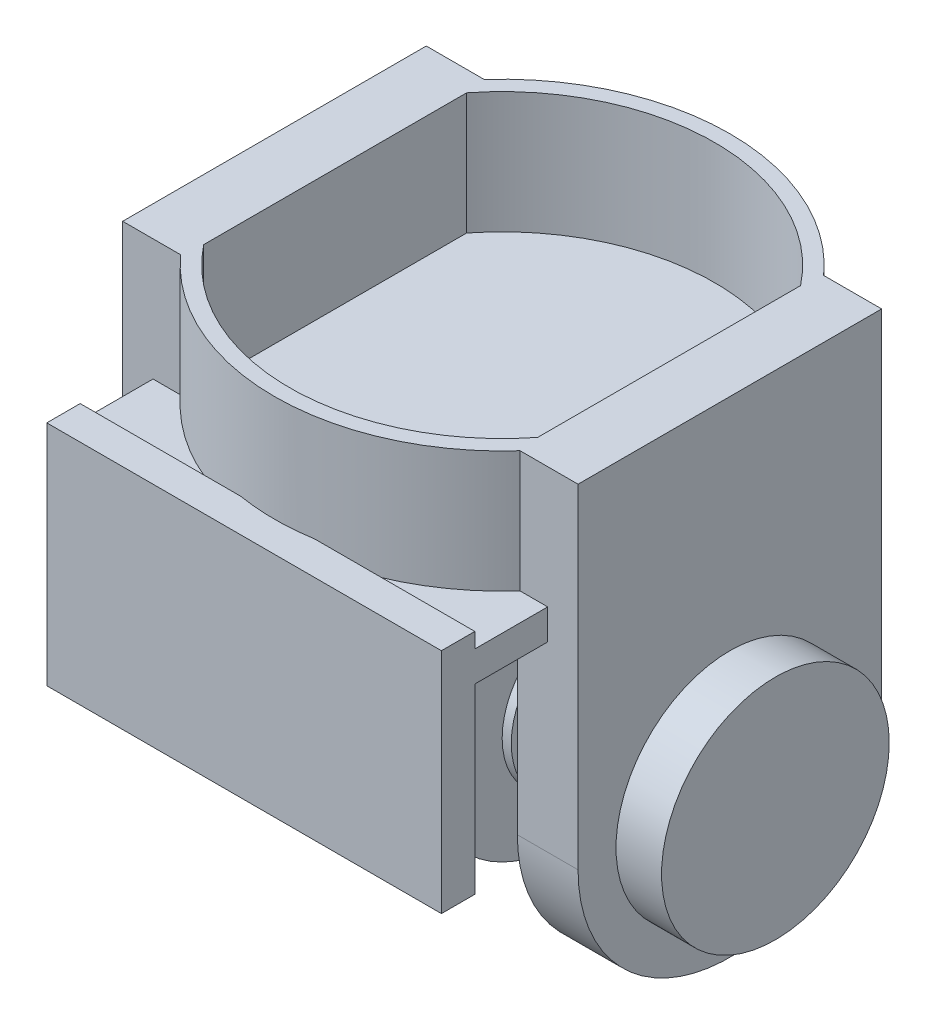
ISO-10303-21;
HEADER;
FILE_DESCRIPTION(('STEP AP214'),'2;1');
FILE_NAME('part.step','',(''),(''),'','','');
FILE_SCHEMA(('AUTOMOTIVE_DESIGN { 1 0 10303 214 1 1 1 1 }'));
ENDSEC;
DATA;
#1=APPLICATION_CONTEXT('core data for automotive mechanical design processes');
#2=APPLICATION_PROTOCOL_DEFINITION('international standard','automotive_design',2000,#1);
#3=PRODUCT_CONTEXT('',#1,'mechanical');
#4=PRODUCT('Part','Part','',(#3));
#5=PRODUCT_RELATED_PRODUCT_CATEGORY('part','',(#4));
#6=PRODUCT_DEFINITION_FORMATION('','',#4);
#7=PRODUCT_DEFINITION_CONTEXT('part definition',#1,'design');
#8=PRODUCT_DEFINITION('design','',#6,#7);
#9=PRODUCT_DEFINITION_SHAPE('','',#8);
#10=(LENGTH_UNIT() NAMED_UNIT(*) SI_UNIT(.MILLI.,.METRE.));
#11=(NAMED_UNIT(*) PLANE_ANGLE_UNIT() SI_UNIT($,.RADIAN.));
#12=(NAMED_UNIT(*) SI_UNIT($,.STERADIAN.) SOLID_ANGLE_UNIT());
#13=UNCERTAINTY_MEASURE_WITH_UNIT(LENGTH_MEASURE(1.E-05),#10,'distance_accuracy_value','');
#14=(GEOMETRIC_REPRESENTATION_CONTEXT(3) GLOBAL_UNCERTAINTY_ASSIGNED_CONTEXT((#13)) GLOBAL_UNIT_ASSIGNED_CONTEXT((#10,
#11,#12)) REPRESENTATION_CONTEXT('',''));
#15=CARTESIAN_POINT('',(0.,0.,0.));
#16=DIRECTION('',(0.,0.,1.));
#17=DIRECTION('',(1.,0.,0.));
#18=AXIS2_PLACEMENT_3D('',#15,#16,#17);
#19=CARTESIAN_POINT('',(25.,-60.,0.));
#20=DIRECTION('',(1.,0.,0.));
#21=DIRECTION('',(0.,0.,-1.));
#22=AXIS2_PLACEMENT_3D('',#19,#20,#21);
#23=CYLINDRICAL_SURFACE('',#22,25.);
#24=CARTESIAN_POINT('',(25.,-60.,0.));
#25=DIRECTION('',(-1.,0.,0.));
#26=DIRECTION('',(0.,0.,1.));
#27=AXIS2_PLACEMENT_3D('',#24,#25,#26);
#28=CIRCLE('',#27,25.);
#29=CARTESIAN_POINT('',(25.,-60.,25.));
#30=VERTEX_POINT('',#29);
#31=EDGE_CURVE('E11',#30,#30,#28,.T.);
#32=ORIENTED_EDGE('',*,*,#31,.F.);
#33=EDGE_LOOP('',(#32));
#34=FACE_BOUND('',#33,.T.);
#35=CARTESIAN_POINT('',(28.,-60.,0.));
#36=DIRECTION('',(-1.,0.,0.));
#37=DIRECTION('',(0.,0.,1.));
#38=AXIS2_PLACEMENT_3D('',#35,#36,#37);
#39=CIRCLE('',#38,25.);
#40=CARTESIAN_POINT('',(28.,-60.,25.));
#41=VERTEX_POINT('',#40);
#42=EDGE_CURVE('E46',#41,#41,#39,.T.);
#43=ORIENTED_EDGE('',*,*,#42,.T.);
#44=EDGE_LOOP('',(#43));
#45=FACE_BOUND('',#44,.T.);
#46=ADVANCED_FACE('F43',(#34,#45),#23,.T.);
#47=CARTESIAN_POINT('',(25.,-60.,0.));
#48=DIRECTION('',(-1.,0.,0.));
#49=DIRECTION('',(0.,0.,1.));
#50=AXIS2_PLACEMENT_3D('',#47,#48,#49);
#51=PLANE('',#50);
#52=ORIENTED_EDGE('',*,*,#31,.T.);
#53=EDGE_LOOP('',(#52));
#54=FACE_BOUND('',#53,.T.);
#55=ADVANCED_FACE('F58',(#54),#51,.T.);
#56=CARTESIAN_POINT('',(28.,-60.,0.));
#57=DIRECTION('',(-1.,0.,0.));
#58=DIRECTION('',(0.,0.,1.));
#59=AXIS2_PLACEMENT_3D('',#56,#57,#58);
#60=PLANE('',#59);
#61=ORIENTED_EDGE('',*,*,#42,.F.);
#62=EDGE_LOOP('',(#61));
#63=FACE_BOUND('',#62,.T.);
#64=ADVANCED_FACE('F56',(#63),#60,.F.);
#65=CLOSED_SHELL('',(#46,#55,#64));
#66=MANIFOLD_SOLID_BREP('B2',#65);
#67=CARTESIAN_POINT('',(7.00000000000002,-60.,0.));
#68=DIRECTION('',(1.,0.,0.));
#69=DIRECTION('',(0.,0.,-1.));
#70=AXIS2_PLACEMENT_3D('',#67,#68,#69);
#71=CYLINDRICAL_SURFACE('',#70,22.5);
#72=CARTESIAN_POINT('',(7.00000000000002,-60.,0.));
#73=DIRECTION('',(-1.,0.,0.));
#74=DIRECTION('',(0.,0.,1.));
#75=AXIS2_PLACEMENT_3D('',#72,#73,#74);
#76=CIRCLE('',#75,22.5);
#77=CARTESIAN_POINT('',(7.00000000000002,-60.,22.5));
#78=VERTEX_POINT('',#77);
#79=EDGE_CURVE('E42',#78,#78,#76,.T.);
#80=ORIENTED_EDGE('',*,*,#79,.F.);
#81=EDGE_LOOP('',(#80));
#82=FACE_BOUND('',#81,.T.);
#83=CARTESIAN_POINT('',(10.,-60.,0.));
#84=DIRECTION('',(-1.,0.,0.));
#85=DIRECTION('',(0.,0.,1.));
#86=AXIS2_PLACEMENT_3D('',#83,#84,#85);
#87=CIRCLE('',#86,22.5);
#88=CARTESIAN_POINT('',(10.,-60.,22.5));
#89=VERTEX_POINT('',#88);
#90=EDGE_CURVE('E94',#89,#89,#87,.T.);
#91=ORIENTED_EDGE('',*,*,#90,.T.);
#92=EDGE_LOOP('',(#91));
#93=FACE_BOUND('',#92,.T.);
#94=ADVANCED_FACE('F91',(#82,#93),#71,.T.);
#95=CARTESIAN_POINT('',(7.00000000000002,-60.,0.));
#96=DIRECTION('',(-1.,0.,0.));
#97=DIRECTION('',(0.,0.,1.));
#98=AXIS2_PLACEMENT_3D('',#95,#96,#97);
#99=PLANE('',#98);
#100=ORIENTED_EDGE('',*,*,#79,.T.);
#101=EDGE_LOOP('',(#100));
#102=FACE_BOUND('',#101,.T.);
#103=ADVANCED_FACE('F106',(#102),#99,.T.);
#104=CARTESIAN_POINT('',(10.,-60.,0.));
#105=DIRECTION('',(-1.,0.,0.));
#106=DIRECTION('',(0.,0.,1.));
#107=AXIS2_PLACEMENT_3D('',#104,#105,#106);
#108=PLANE('',#107);
#109=ORIENTED_EDGE('',*,*,#90,.F.);
#110=EDGE_LOOP('',(#109));
#111=FACE_BOUND('',#110,.T.);
#112=ADVANCED_FACE('F104',(#111),#108,.F.);
#113=CLOSED_SHELL('',(#94,#103,#112));
#114=MANIFOLD_SOLID_BREP('B6',#113);
#115=CARTESIAN_POINT('',(-7.00000000000001,-60.,0.));
#116=DIRECTION('',(-1.,0.,0.));
#117=DIRECTION('',(0.,0.,1.));
#118=AXIS2_PLACEMENT_3D('',#115,#116,#117);
#119=CYLINDRICAL_SURFACE('',#118,22.5);
#120=CARTESIAN_POINT('',(-7.00000000000001,-60.,0.));
#121=DIRECTION('',(1.,0.,0.));
#122=DIRECTION('',(0.,0.,-1.));
#123=AXIS2_PLACEMENT_3D('',#120,#121,#122);
#124=CIRCLE('',#123,22.5);
#125=CARTESIAN_POINT('',(-7.00000000000001,-60.,-22.5));
#126=VERTEX_POINT('',#125);
#127=EDGE_CURVE('E90',#126,#126,#124,.T.);
#128=ORIENTED_EDGE('',*,*,#127,.F.);
#129=EDGE_LOOP('',(#128));
#130=FACE_BOUND('',#129,.T.);
#131=CARTESIAN_POINT('',(-10.,-60.,0.));
#132=DIRECTION('',(1.,0.,0.));
#133=DIRECTION('',(0.,0.,-1.));
#134=AXIS2_PLACEMENT_3D('',#131,#132,#133);
#135=CIRCLE('',#134,22.5);
#136=CARTESIAN_POINT('',(-10.,-60.,-22.5));
#137=VERTEX_POINT('',#136);
#138=EDGE_CURVE('E142',#137,#137,#135,.T.);
#139=ORIENTED_EDGE('',*,*,#138,.T.);
#140=EDGE_LOOP('',(#139));
#141=FACE_BOUND('',#140,.T.);
#142=ADVANCED_FACE('F139',(#130,#141),#119,.T.);
#143=CARTESIAN_POINT('',(-7.00000000000001,-60.,0.));
#144=DIRECTION('',(1.,0.,0.));
#145=DIRECTION('',(0.,0.,-1.));
#146=AXIS2_PLACEMENT_3D('',#143,#144,#145);
#147=PLANE('',#146);
#148=ORIENTED_EDGE('',*,*,#127,.T.);
#149=EDGE_LOOP('',(#148));
#150=FACE_BOUND('',#149,.T.);
#151=ADVANCED_FACE('F154',(#150),#147,.T.);
#152=CARTESIAN_POINT('',(-10.,-60.,0.));
#153=DIRECTION('',(1.,0.,0.));
#154=DIRECTION('',(0.,0.,-1.));
#155=AXIS2_PLACEMENT_3D('',#152,#153,#154);
#156=PLANE('',#155);
#157=ORIENTED_EDGE('',*,*,#138,.F.);
#158=EDGE_LOOP('',(#157));
#159=FACE_BOUND('',#158,.T.);
#160=ADVANCED_FACE('F152',(#159),#156,.F.);
#161=CLOSED_SHELL('',(#142,#151,#160));
#162=MANIFOLD_SOLID_BREP('B37',#161);
#163=CARTESIAN_POINT('',(20.,-60.,0.));
#164=DIRECTION('',(-1.,0.,0.));
#165=DIRECTION('',(0.,0.,1.));
#166=AXIS2_PLACEMENT_3D('',#163,#164,#165);
#167=CYLINDRICAL_SURFACE('',#166,45.);
#168=CARTESIAN_POINT('',(-20.,-60.,0.));
#169=DIRECTION('',(1.,0.,0.));
#170=DIRECTION('',(0.,0.,-1.));
#171=AXIS2_PLACEMENT_3D('',#168,#169,#170);
#172=CIRCLE('',#171,45.);
#173=CARTESIAN_POINT('',(-20.,-60.,-45.));
#174=VERTEX_POINT('',#173);
#175=EDGE_CURVE('E193',#174,#174,#172,.T.);
#176=ORIENTED_EDGE('',*,*,#175,.T.);
#177=EDGE_LOOP('',(#176));
#178=FACE_BOUND('',#177,.T.);
#179=CARTESIAN_POINT('',(-17.5,-60.,0.));
#180=DIRECTION('',(1.,0.,0.));
#181=DIRECTION('',(0.,0.,-1.));
#182=AXIS2_PLACEMENT_3D('',#179,#180,#181);
#183=CIRCLE('',#182,45.);
#184=CARTESIAN_POINT('',(-17.5,-60.,-45.));
#185=VERTEX_POINT('',#184);
#186=EDGE_CURVE('E138',#185,#185,#183,.T.);
#187=ORIENTED_EDGE('',*,*,#186,.F.);
#188=EDGE_LOOP('',(#187));
#189=FACE_BOUND('',#188,.T.);
#190=ADVANCED_FACE('F187',(#178,#189),#167,.T.);
#191=CARTESIAN_POINT('',(-20.,-60.,0.));
#192=DIRECTION('',(1.,0.,0.));
#193=DIRECTION('',(0.,0.,-1.));
#194=AXIS2_PLACEMENT_3D('',#191,#192,#193);
#195=PLANE('',#194);
#196=ORIENTED_EDGE('',*,*,#175,.F.);
#197=EDGE_LOOP('',(#196));
#198=FACE_BOUND('',#197,.T.);
#199=ADVANCED_FACE('F201',(#198),#195,.F.);
#200=CARTESIAN_POINT('',(-17.5,-60.,0.));
#201=DIRECTION('',(1.,0.,0.));
#202=DIRECTION('',(0.,0.,-1.));
#203=AXIS2_PLACEMENT_3D('',#200,#201,#202);
#204=PLANE('',#203);
#205=ORIENTED_EDGE('',*,*,#186,.T.);
#206=EDGE_LOOP('',(#205));
#207=FACE_BOUND('',#206,.T.);
#208=ADVANCED_FACE('F203',(#207),#204,.T.);
#209=CLOSED_SHELL('',(#190,#199,#208));
#210=MANIFOLD_SOLID_BREP('B85',#209);
#211=CARTESIAN_POINT('',(20.,-60.,0.));
#212=DIRECTION('',(1.,0.,0.));
#213=DIRECTION('',(0.,0.,-1.));
#214=AXIS2_PLACEMENT_3D('',#211,#212,#213);
#215=PLANE('',#214);
#216=CARTESIAN_POINT('',(20.,-60.,0.));
#217=DIRECTION('',(1.,0.,0.));
#218=DIRECTION('',(0.,0.,-1.));
#219=AXIS2_PLACEMENT_3D('',#216,#217,#218);
#220=CIRCLE('',#219,45.);
#221=CARTESIAN_POINT('',(20.,-60.,-45.));
#222=VERTEX_POINT('',#221);
#223=EDGE_CURVE('E186',#222,#222,#220,.T.);
#224=ORIENTED_EDGE('',*,*,#223,.T.);
#225=EDGE_LOOP('',(#224));
#226=FACE_BOUND('',#225,.T.);
#227=ADVANCED_FACE('F236',(#226),#215,.T.);
#228=CARTESIAN_POINT('',(20.,-60.,0.));
#229=DIRECTION('',(-1.,0.,0.));
#230=DIRECTION('',(0.,0.,1.));
#231=AXIS2_PLACEMENT_3D('',#228,#229,#230);
#232=CYLINDRICAL_SURFACE('',#231,45.);
#233=CARTESIAN_POINT('',(17.5,-60.,0.));
#234=DIRECTION('',(1.,0.,0.));
#235=DIRECTION('',(0.,0.,-1.));
#236=AXIS2_PLACEMENT_3D('',#233,#234,#235);
#237=CIRCLE('',#236,45.);
#238=CARTESIAN_POINT('',(17.5,-60.,-45.));
#239=VERTEX_POINT('',#238);
#240=EDGE_CURVE('E243',#239,#239,#237,.T.);
#241=ORIENTED_EDGE('',*,*,#240,.T.);
#242=EDGE_LOOP('',(#241));
#243=FACE_BOUND('',#242,.T.);
#244=ORIENTED_EDGE('',*,*,#223,.F.);
#245=EDGE_LOOP('',(#244));
#246=FACE_BOUND('',#245,.T.);
#247=ADVANCED_FACE('F238',(#243,#246),#232,.T.);
#248=CARTESIAN_POINT('',(17.5,-60.,0.));
#249=DIRECTION('',(1.,0.,0.));
#250=DIRECTION('',(0.,0.,-1.));
#251=AXIS2_PLACEMENT_3D('',#248,#249,#250);
#252=PLANE('',#251);
#253=ORIENTED_EDGE('',*,*,#240,.F.);
#254=EDGE_LOOP('',(#253));
#255=FACE_BOUND('',#254,.T.);
#256=ADVANCED_FACE('F251',(#255),#252,.F.);
#257=CLOSED_SHELL('',(#227,#247,#256));
#258=MANIFOLD_SOLID_BREP('B133',#257);
#259=CARTESIAN_POINT('',(0.,50.,0.));
#260=DIRECTION('',(0.,-1.,0.));
#261=DIRECTION('',(0.,0.,-1.));
#262=AXIS2_PLACEMENT_3D('',#259,#260,#261);
#263=CYLINDRICAL_SURFACE('',#262,75.);
#264=DIRECTION('',(0.,-1.,0.));
#265=VECTOR('',#264,1.);
#266=CARTESIAN_POINT('',(-12.2065556157337,50.,74.));
#267=LINE('',#266,#265);
#268=CARTESIAN_POINT('',(-12.2065556157337,15.,74.));
#269=VERTEX_POINT('',#268);
#270=CARTESIAN_POINT('',(-12.2065556157337,10.,74.));
#271=VERTEX_POINT('',#270);
#272=EDGE_CURVE('E289',#269,#271,#267,.T.);
#273=ORIENTED_EDGE('',*,*,#272,.F.);
#274=CARTESIAN_POINT('',(0.,15.,0.));
#275=DIRECTION('',(0.,1.,0.));
#276=DIRECTION('',(0.,0.,1.));
#277=AXIS2_PLACEMENT_3D('',#274,#275,#276);
#278=CIRCLE('',#277,75.);
#279=CARTESIAN_POINT('',(12.2065556157337,15.,74.));
#280=VERTEX_POINT('',#279);
#281=EDGE_CURVE('E234',#269,#280,#278,.T.);
#282=ORIENTED_EDGE('',*,*,#281,.T.);
#283=DIRECTION('',(0.,-1.,0.));
#284=VECTOR('',#283,1.);
#285=CARTESIAN_POINT('',(12.2065556157337,50.,74.));
#286=LINE('',#285,#284);
#287=CARTESIAN_POINT('',(12.2065556157337,10.,74.));
#288=VERTEX_POINT('',#287);
#289=EDGE_CURVE('E491',#288,#280,#286,.F.);
#290=ORIENTED_EDGE('',*,*,#289,.F.);
#291=CARTESIAN_POINT('',(0.,10.,0.));
#292=DIRECTION('',(0.,-1.,0.));
#293=DIRECTION('',(0.,0.,-1.));
#294=AXIS2_PLACEMENT_3D('',#291,#292,#293);
#295=CIRCLE('',#294,75.);
#296=CARTESIAN_POINT('',(55.9016994374947,9.99999999999999,50.));
#297=VERTEX_POINT('',#296);
#298=EDGE_CURVE('E514',#297,#288,#295,.T.);
#299=ORIENTED_EDGE('',*,*,#298,.F.);
#300=DIRECTION('',(0.,-1.,0.));
#301=VECTOR('',#300,1.);
#302=CARTESIAN_POINT('',(55.9016994374947,50.,50.));
#303=LINE('',#302,#301);
#304=CARTESIAN_POINT('',(55.9016994374948,50.,50.));
#305=VERTEX_POINT('',#304);
#306=EDGE_CURVE('E615',#297,#305,#303,.F.);
#307=ORIENTED_EDGE('',*,*,#306,.T.);
#308=CARTESIAN_POINT('',(0.,50.,0.));
#309=DIRECTION('',(0.,1.,0.));
#310=DIRECTION('',(0.,0.,1.));
#311=AXIS2_PLACEMENT_3D('',#308,#309,#310);
#312=CIRCLE('',#311,75.);
#313=CARTESIAN_POINT('',(-55.9016994374947,50.,50.));
#314=VERTEX_POINT('',#313);
#315=EDGE_CURVE('E629',#314,#305,#312,.T.);
#316=ORIENTED_EDGE('',*,*,#315,.F.);
#317=DIRECTION('',(0.,-1.,0.));
#318=VECTOR('',#317,1.);
#319=CARTESIAN_POINT('',(-55.9016994374947,50.,50.));
#320=LINE('',#319,#318);
#321=CARTESIAN_POINT('',(-55.9016994374947,9.99999999999999,50.));
#322=VERTEX_POINT('',#321);
#323=EDGE_CURVE('E571',#314,#322,#320,.T.);
#324=ORIENTED_EDGE('',*,*,#323,.T.);
#325=EDGE_CURVE('E510',#271,#322,#295,.T.);
#326=ORIENTED_EDGE('',*,*,#325,.F.);
#327=EDGE_LOOP('',(#273,#282,#290,#299,#307,#316,#324,#326));
#328=FACE_BOUND('',#327,.T.);
#329=ADVANCED_FACE('F276',(#328),#263,.T.);
#330=CARTESIAN_POINT('',(0.,0.,0.));
#331=DIRECTION('',(0.,1.,0.));
#332=DIRECTION('',(0.,0.,1.));
#333=AXIS2_PLACEMENT_3D('',#330,#331,#332);
#334=PLANE('',#333);
#335=DIRECTION('',(1.,0.,0.));
#336=VECTOR('',#335,1.);
#337=CARTESIAN_POINT('',(0.,0.,74.));
#338=LINE('',#337,#336);
#339=CARTESIAN_POINT('',(-65.,0.,74.));
#340=VERTEX_POINT('',#339);
#341=CARTESIAN_POINT('',(65.,0.,74.));
#342=VERTEX_POINT('',#341);
#343=EDGE_CURVE('E500',#340,#342,#338,.T.);
#344=ORIENTED_EDGE('',*,*,#343,.F.);
#345=DIRECTION('',(0.,0.,-1.));
#346=VECTOR('',#345,1.);
#347=CARTESIAN_POINT('',(-65.,0.,0.));
#348=LINE('',#347,#346);
#349=CARTESIAN_POINT('',(-65.,0.,50.));
#350=VERTEX_POINT('',#349);
#351=EDGE_CURVE('E508',#340,#350,#348,.T.);
#352=ORIENTED_EDGE('',*,*,#351,.T.);
#353=DIRECTION('',(1.,0.,0.));
#354=VECTOR('',#353,1.);
#355=CARTESIAN_POINT('',(0.,0.,50.));
#356=LINE('',#355,#354);
#357=CARTESIAN_POINT('',(-55.,0.,50.));
#358=VERTEX_POINT('',#357);
#359=EDGE_CURVE('E640',#350,#358,#356,.T.);
#360=ORIENTED_EDGE('',*,*,#359,.T.);
#361=DIRECTION('',(0.,0.,-1.));
#362=VECTOR('',#361,1.);
#363=CARTESIAN_POINT('',(-55.,0.,0.));
#364=LINE('',#363,#362);
#365=CARTESIAN_POINT('',(-55.,0.,-50.));
#366=VERTEX_POINT('',#365);
#367=EDGE_CURVE('E569',#358,#366,#364,.T.);
#368=ORIENTED_EDGE('',*,*,#367,.T.);
#369=DIRECTION('',(-1.,0.,0.));
#370=VECTOR('',#369,1.);
#371=CARTESIAN_POINT('',(0.,0.,-50.));
#372=LINE('',#371,#370);
#373=CARTESIAN_POINT('',(-55.9016994374948,0.,-50.));
#374=VERTEX_POINT('',#373);
#375=EDGE_CURVE('E643',#366,#374,#372,.T.);
#376=ORIENTED_EDGE('',*,*,#375,.T.);
#377=CARTESIAN_POINT('',(0.,0.,0.));
#378=DIRECTION('',(0.,1.,0.));
#379=DIRECTION('',(0.,0.,1.));
#380=AXIS2_PLACEMENT_3D('',#377,#378,#379);
#381=CIRCLE('',#380,75.);
#382=CARTESIAN_POINT('',(55.9016994374948,0.,-50.));
#383=VERTEX_POINT('',#382);
#384=EDGE_CURVE('E621',#383,#374,#381,.T.);
#385=ORIENTED_EDGE('',*,*,#384,.F.);
#386=DIRECTION('',(-1.,0.,0.));
#387=VECTOR('',#386,1.);
#388=CARTESIAN_POINT('',(0.,0.,-50.));
#389=LINE('',#388,#387);
#390=CARTESIAN_POINT('',(55.,0.,-50.));
#391=VERTEX_POINT('',#390);
#392=EDGE_CURVE('E633',#383,#391,#389,.T.);
#393=ORIENTED_EDGE('',*,*,#392,.T.);
#394=DIRECTION('',(0.,0.,1.));
#395=VECTOR('',#394,1.);
#396=CARTESIAN_POINT('',(55.,0.,0.));
#397=LINE('',#396,#395);
#398=CARTESIAN_POINT('',(55.,0.,50.));
#399=VERTEX_POINT('',#398);
#400=EDGE_CURVE('E610',#391,#399,#397,.T.);
#401=ORIENTED_EDGE('',*,*,#400,.T.);
#402=DIRECTION('',(1.,0.,0.));
#403=VECTOR('',#402,1.);
#404=CARTESIAN_POINT('',(0.,0.,50.));
#405=LINE('',#404,#403);
#406=CARTESIAN_POINT('',(65.,0.,50.));
#407=VERTEX_POINT('',#406);
#408=EDGE_CURVE('E636',#399,#407,#405,.T.);
#409=ORIENTED_EDGE('',*,*,#408,.T.);
#410=DIRECTION('',(0.,0.,1.));
#411=VECTOR('',#410,1.);
#412=CARTESIAN_POINT('',(65.,0.,0.));
#413=LINE('',#412,#411);
#414=EDGE_CURVE('E503',#407,#342,#413,.T.);
#415=ORIENTED_EDGE('',*,*,#414,.T.);
#416=EDGE_LOOP('',(#344,#352,#360,#368,#376,#385,#393,#401,#409,#415));
#417=FACE_BOUND('',#416,.T.);
#418=ADVANCED_FACE('F696',(#417),#334,.F.);
#419=CARTESIAN_POINT('',(0.,10.,0.));
#420=DIRECTION('',(0.,-1.,0.));
#421=DIRECTION('',(0.,0.,-1.));
#422=AXIS2_PLACEMENT_3D('',#419,#420,#421);
#423=PLANE('',#422);
#424=DIRECTION('',(-1.,0.,0.));
#425=VECTOR('',#424,1.);
#426=CARTESIAN_POINT('',(0.,10.,74.));
#427=LINE('',#426,#425);
#428=CARTESIAN_POINT('',(-65.,10.,74.));
#429=VERTEX_POINT('',#428);
#430=EDGE_CURVE('E496',#271,#429,#427,.T.);
#431=ORIENTED_EDGE('',*,*,#430,.F.);
#432=ORIENTED_EDGE('',*,*,#325,.T.);
#433=DIRECTION('',(1.,0.,0.));
#434=VECTOR('',#433,1.);
#435=CARTESIAN_POINT('',(-75.,9.99999999999999,50.));
#436=LINE('',#435,#434);
#437=CARTESIAN_POINT('',(-65.,9.99999999999999,50.));
#438=VERTEX_POINT('',#437);
#439=EDGE_CURVE('E649',#438,#322,#436,.T.);
#440=ORIENTED_EDGE('',*,*,#439,.F.);
#441=DIRECTION('',(0.,0.,-1.));
#442=VECTOR('',#441,1.);
#443=CARTESIAN_POINT('',(-65.,10.,0.));
#444=LINE('',#443,#442);
#445=EDGE_CURVE('E507',#429,#438,#444,.T.);
#446=ORIENTED_EDGE('',*,*,#445,.F.);
#447=EDGE_LOOP('',(#431,#432,#440,#446));
#448=FACE_BOUND('',#447,.T.);
#449=ADVANCED_FACE('F694',(#448),#423,.F.);
#450=DIRECTION('',(-1.,0.,0.));
#451=VECTOR('',#450,1.);
#452=CARTESIAN_POINT('',(0.,10.,74.));
#453=LINE('',#452,#451);
#454=CARTESIAN_POINT('',(65.,10.,74.));
#455=VERTEX_POINT('',#454);
#456=EDGE_CURVE('E283',#455,#288,#453,.T.);
#457=ORIENTED_EDGE('',*,*,#456,.F.);
#458=DIRECTION('',(0.,0.,1.));
#459=VECTOR('',#458,1.);
#460=CARTESIAN_POINT('',(65.,10.,0.));
#461=LINE('',#460,#459);
#462=CARTESIAN_POINT('',(65.,9.99999999999999,50.));
#463=VERTEX_POINT('',#462);
#464=EDGE_CURVE('E504',#463,#455,#461,.T.);
#465=ORIENTED_EDGE('',*,*,#464,.F.);
#466=DIRECTION('',(1.,0.,0.));
#467=VECTOR('',#466,1.);
#468=CARTESIAN_POINT('',(75.,9.99999999999999,50.));
#469=LINE('',#468,#467);
#470=EDGE_CURVE('E515',#297,#463,#469,.T.);
#471=ORIENTED_EDGE('',*,*,#470,.F.);
#472=ORIENTED_EDGE('',*,*,#298,.T.);
#473=EDGE_LOOP('',(#457,#465,#471,#472));
#474=FACE_BOUND('',#473,.T.);
#475=ADVANCED_FACE('F661',(#474),#423,.F.);
#476=CARTESIAN_POINT('',(75.,-60.,50.));
#477=DIRECTION('',(0.,0.,1.));
#478=DIRECTION('',(1.,0.,0.));
#479=AXIS2_PLACEMENT_3D('',#476,#477,#478);
#480=PLANE('',#479);
#481=ORIENTED_EDGE('',*,*,#306,.F.);
#482=ORIENTED_EDGE('',*,*,#470,.T.);
#483=DIRECTION('',(0.,1.,0.));
#484=VECTOR('',#483,1.);
#485=CARTESIAN_POINT('',(65.,-60.,50.));
#486=LINE('',#485,#484);
#487=EDGE_CURVE('E652',#407,#463,#486,.T.);
#488=ORIENTED_EDGE('',*,*,#487,.F.);
#489=ORIENTED_EDGE('',*,*,#408,.F.);
#490=DIRECTION('',(0.,1.,0.));
#491=VECTOR('',#490,1.);
#492=CARTESIAN_POINT('',(55.,-60.,50.));
#493=LINE('',#492,#491);
#494=CARTESIAN_POINT('',(55.,-60.,50.));
#495=VERTEX_POINT('',#494);
#496=EDGE_CURVE('E599',#495,#399,#493,.T.);
#497=ORIENTED_EDGE('',*,*,#496,.F.);
#498=DIRECTION('',(1.,0.,0.));
#499=VECTOR('',#498,1.);
#500=CARTESIAN_POINT('',(75.,-60.,50.));
#501=LINE('',#500,#499);
#502=CARTESIAN_POINT('',(75.,-60.,50.));
#503=VERTEX_POINT('',#502);
#504=EDGE_CURVE('E581',#495,#503,#501,.T.);
#505=ORIENTED_EDGE('',*,*,#504,.T.);
#506=DIRECTION('',(0.,1.,0.));
#507=VECTOR('',#506,1.);
#508=CARTESIAN_POINT('',(75.,-60.,50.));
#509=LINE('',#508,#507);
#510=CARTESIAN_POINT('',(75.,50.,50.));
#511=VERTEX_POINT('',#510);
#512=EDGE_CURVE('E595',#503,#511,#509,.T.);
#513=ORIENTED_EDGE('',*,*,#512,.T.);
#514=DIRECTION('',(1.,0.,0.));
#515=VECTOR('',#514,1.);
#516=CARTESIAN_POINT('',(75.,50.,50.));
#517=LINE('',#516,#515);
#518=EDGE_CURVE('E582',#305,#511,#517,.T.);
#519=ORIENTED_EDGE('',*,*,#518,.F.);
#520=EDGE_LOOP('',(#481,#482,#488,#489,#497,#505,#513,#519));
#521=FACE_BOUND('',#520,.T.);
#522=ADVANCED_FACE('F671',(#521),#480,.T.);
#523=CARTESIAN_POINT('',(-75.,-60.,50.));
#524=DIRECTION('',(0.,0.,1.));
#525=DIRECTION('',(1.,0.,0.));
#526=AXIS2_PLACEMENT_3D('',#523,#524,#525);
#527=PLANE('',#526);
#528=DIRECTION('',(0.,-1.,0.));
#529=VECTOR('',#528,1.);
#530=CARTESIAN_POINT('',(-65.,-60.,50.));
#531=LINE('',#530,#529);
#532=EDGE_CURVE('E646',#438,#350,#531,.T.);
#533=ORIENTED_EDGE('',*,*,#532,.F.);
#534=ORIENTED_EDGE('',*,*,#439,.T.);
#535=ORIENTED_EDGE('',*,*,#323,.F.);
#536=DIRECTION('',(1.,0.,0.));
#537=VECTOR('',#536,1.);
#538=CARTESIAN_POINT('',(-75.,50.,50.));
#539=LINE('',#538,#537);
#540=CARTESIAN_POINT('',(-75.,50.,50.));
#541=VERTEX_POINT('',#540);
#542=EDGE_CURVE('E536',#541,#314,#539,.T.);
#543=ORIENTED_EDGE('',*,*,#542,.F.);
#544=DIRECTION('',(0.,1.,0.));
#545=VECTOR('',#544,1.);
#546=CARTESIAN_POINT('',(-75.,-60.,50.));
#547=LINE('',#546,#545);
#548=CARTESIAN_POINT('',(-75.,-60.,50.));
#549=VERTEX_POINT('',#548);
#550=EDGE_CURVE('E545',#549,#541,#547,.T.);
#551=ORIENTED_EDGE('',*,*,#550,.F.);
#552=DIRECTION('',(1.,0.,0.));
#553=VECTOR('',#552,1.);
#554=CARTESIAN_POINT('',(-75.,-60.,50.));
#555=LINE('',#554,#553);
#556=CARTESIAN_POINT('',(-55.,-60.,50.));
#557=VERTEX_POINT('',#556);
#558=EDGE_CURVE('E538',#549,#557,#555,.T.);
#559=ORIENTED_EDGE('',*,*,#558,.T.);
#560=DIRECTION('',(0.,1.,0.));
#561=VECTOR('',#560,1.);
#562=CARTESIAN_POINT('',(-55.,-60.,50.));
#563=LINE('',#562,#561);
#564=EDGE_CURVE('E561',#557,#358,#563,.T.);
#565=ORIENTED_EDGE('',*,*,#564,.T.);
#566=ORIENTED_EDGE('',*,*,#359,.F.);
#567=EDGE_LOOP('',(#533,#534,#535,#543,#551,#559,#565,#566));
#568=FACE_BOUND('',#567,.T.);
#569=ADVANCED_FACE('F684',(#568),#527,.T.);
#570=CARTESIAN_POINT('',(-75.,-60.,0.));
#571=DIRECTION('',(-1.,0.,0.));
#572=DIRECTION('',(0.,0.,1.));
#573=AXIS2_PLACEMENT_3D('',#570,#571,#572);
#574=PLANE('',#573);
#575=DIRECTION('',(0.,1.,0.));
#576=VECTOR('',#575,1.);
#577=CARTESIAN_POINT('',(-75.,-60.,-50.));
#578=LINE('',#577,#576);
#579=CARTESIAN_POINT('',(-75.,-60.,-50.));
#580=VERTEX_POINT('',#579);
#581=CARTESIAN_POINT('',(-75.,50.,-50.));
#582=VERTEX_POINT('',#581);
#583=EDGE_CURVE('E554',#580,#582,#578,.T.);
#584=ORIENTED_EDGE('',*,*,#583,.F.);
#585=CARTESIAN_POINT('',(-75.,-60.,0.));
#586=DIRECTION('',(-1.,0.,0.));
#587=DIRECTION('',(0.,0.,1.));
#588=AXIS2_PLACEMENT_3D('',#585,#586,#587);
#589=CIRCLE('',#588,50.);
#590=EDGE_CURVE('E532',#580,#549,#589,.T.);
#591=ORIENTED_EDGE('',*,*,#590,.T.);
#592=ORIENTED_EDGE('',*,*,#550,.T.);
#593=DIRECTION('',(0.,0.,1.));
#594=VECTOR('',#593,1.);
#595=CARTESIAN_POINT('',(-75.,50.,0.));
#596=LINE('',#595,#594);
#597=EDGE_CURVE('E542',#582,#541,#596,.T.);
#598=ORIENTED_EDGE('',*,*,#597,.F.);
#599=EDGE_LOOP('',(#584,#591,#592,#598));
#600=FACE_BOUND('',#599,.T.);
#601=CARTESIAN_POINT('',(-75.,-60.,0.));
#602=DIRECTION('',(-1.,0.,0.));
#603=DIRECTION('',(0.,0.,1.));
#604=AXIS2_PLACEMENT_3D('',#601,#602,#603);
#605=CIRCLE('',#604,37.5);
#606=CARTESIAN_POINT('',(-75.,-60.,37.5));
#607=VERTEX_POINT('',#606);
#608=EDGE_CURVE('E517',#607,#607,#605,.T.);
#609=ORIENTED_EDGE('',*,*,#608,.F.);
#610=EDGE_LOOP('',(#609));
#611=FACE_BOUND('',#610,.T.);
#612=ADVANCED_FACE('F720',(#600,#611),#574,.T.);
#613=CARTESIAN_POINT('',(75.,-60.,0.));
#614=DIRECTION('',(1.,0.,0.));
#615=DIRECTION('',(0.,0.,-1.));
#616=AXIS2_PLACEMENT_3D('',#613,#614,#615);
#617=PLANE('',#616);
#618=ORIENTED_EDGE('',*,*,#512,.F.);
#619=CARTESIAN_POINT('',(75.,-60.,0.));
#620=DIRECTION('',(1.,0.,0.));
#621=DIRECTION('',(0.,0.,-1.));
#622=AXIS2_PLACEMENT_3D('',#619,#620,#621);
#623=CIRCLE('',#622,50.);
#624=CARTESIAN_POINT('',(75.,-60.,-50.));
#625=VERTEX_POINT('',#624);
#626=EDGE_CURVE('E527',#503,#625,#623,.T.);
#627=ORIENTED_EDGE('',*,*,#626,.T.);
#628=DIRECTION('',(0.,1.,0.));
#629=VECTOR('',#628,1.);
#630=CARTESIAN_POINT('',(75.,-60.,-50.));
#631=LINE('',#630,#629);
#632=CARTESIAN_POINT('',(75.,50.,-50.));
#633=VERTEX_POINT('',#632);
#634=EDGE_CURVE('E585',#625,#633,#631,.T.);
#635=ORIENTED_EDGE('',*,*,#634,.T.);
#636=DIRECTION('',(0.,0.,-1.));
#637=VECTOR('',#636,1.);
#638=CARTESIAN_POINT('',(75.,50.,0.));
#639=LINE('',#638,#637);
#640=EDGE_CURVE('E577',#511,#633,#639,.T.);
#641=ORIENTED_EDGE('',*,*,#640,.F.);
#642=EDGE_LOOP('',(#618,#627,#635,#641));
#643=FACE_BOUND('',#642,.T.);
#644=CARTESIAN_POINT('',(75.,-60.,0.));
#645=DIRECTION('',(1.,0.,0.));
#646=DIRECTION('',(0.,0.,-1.));
#647=AXIS2_PLACEMENT_3D('',#644,#645,#646);
#648=CIRCLE('',#647,37.5);
#649=CARTESIAN_POINT('',(75.,-60.,-37.5));
#650=VERTEX_POINT('',#649);
#651=EDGE_CURVE('E521',#650,#650,#648,.T.);
#652=ORIENTED_EDGE('',*,*,#651,.F.);
#653=EDGE_LOOP('',(#652));
#654=FACE_BOUND('',#653,.T.);
#655=ADVANCED_FACE('F711',(#643,#654),#617,.T.);
#656=ORIENTED_EDGE('',*,*,#384,.T.);
#657=DIRECTION('',(0.,-1.,0.));
#658=VECTOR('',#657,1.);
#659=CARTESIAN_POINT('',(-55.9016994374948,50.,-50.));
#660=LINE('',#659,#658);
#661=CARTESIAN_POINT('',(-55.9016994374948,50.,-50.));
#662=VERTEX_POINT('',#661);
#663=EDGE_CURVE('E574',#374,#662,#660,.F.);
#664=ORIENTED_EDGE('',*,*,#663,.T.);
#665=CARTESIAN_POINT('',(55.9016994374948,50.,-50.));
#666=VERTEX_POINT('',#665);
#667=EDGE_CURVE('E625',#666,#662,#312,.T.);
#668=ORIENTED_EDGE('',*,*,#667,.F.);
#669=DIRECTION('',(0.,-1.,0.));
#670=VECTOR('',#669,1.);
#671=CARTESIAN_POINT('',(55.9016994374948,50.,-50.));
#672=LINE('',#671,#670);
#673=EDGE_CURVE('E612',#666,#383,#672,.T.);
#674=ORIENTED_EDGE('',*,*,#673,.T.);
#675=EDGE_LOOP('',(#656,#664,#668,#674));
#676=FACE_BOUND('',#675,.T.);
#677=ADVANCED_FACE('F706',(#676),#263,.T.);
#678=CARTESIAN_POINT('',(0.,10.,0.));
#679=DIRECTION('',(0.,1.,0.));
#680=DIRECTION('',(0.,0.,1.));
#681=AXIS2_PLACEMENT_3D('',#678,#679,#680);
#682=CYLINDRICAL_SURFACE('',#681,70.);
#683=CARTESIAN_POINT('',(0.,50.,0.));
#684=DIRECTION('',(0.,1.,0.));
#685=DIRECTION('',(0.,0.,1.));
#686=AXIS2_PLACEMENT_3D('',#683,#684,#685);
#687=CIRCLE('',#686,70.);
#688=CARTESIAN_POINT('',(55.,50.,-43.3012701892219));
#689=VERTEX_POINT('',#688);
#690=CARTESIAN_POINT('',(-55.,50.,-43.3012701892219));
#691=VERTEX_POINT('',#690);
#692=EDGE_CURVE('E623',#689,#691,#687,.T.);
#693=ORIENTED_EDGE('',*,*,#692,.T.);
#694=DIRECTION('',(0.,1.,0.));
#695=VECTOR('',#694,1.);
#696=CARTESIAN_POINT('',(-55.,10.,-43.3012701892219));
#697=LINE('',#696,#695);
#698=CARTESIAN_POINT('',(-55.,10.,-43.3012701892219));
#699=VERTEX_POINT('',#698);
#700=EDGE_CURVE('E566',#691,#699,#697,.F.);
#701=ORIENTED_EDGE('',*,*,#700,.T.);
#702=CARTESIAN_POINT('',(0.,10.,0.));
#703=DIRECTION('',(0.,1.,0.));
#704=DIRECTION('',(0.,0.,1.));
#705=AXIS2_PLACEMENT_3D('',#702,#703,#704);
#706=CIRCLE('',#705,70.);
#707=CARTESIAN_POINT('',(55.,10.,-43.3012701892219));
#708=VERTEX_POINT('',#707);
#709=EDGE_CURVE('E618',#708,#699,#706,.T.);
#710=ORIENTED_EDGE('',*,*,#709,.F.);
#711=DIRECTION('',(0.,1.,0.));
#712=VECTOR('',#711,1.);
#713=CARTESIAN_POINT('',(55.,10.,-43.3012701892219));
#714=LINE('',#713,#712);
#715=EDGE_CURVE('E598',#708,#689,#714,.T.);
#716=ORIENTED_EDGE('',*,*,#715,.T.);
#717=EDGE_LOOP('',(#693,#701,#710,#716));
#718=FACE_BOUND('',#717,.T.);
#719=ADVANCED_FACE('F710',(#718),#682,.F.);
#720=CARTESIAN_POINT('',(0.,50.,0.));
#721=DIRECTION('',(0.,1.,0.));
#722=DIRECTION('',(0.,0.,1.));
#723=AXIS2_PLACEMENT_3D('',#720,#721,#722);
#724=PLANE('',#723);
#725=ORIENTED_EDGE('',*,*,#667,.T.);
#726=DIRECTION('',(-1.,0.,0.));
#727=VECTOR('',#726,1.);
#728=CARTESIAN_POINT('',(-75.,50.,-50.));
#729=LINE('',#728,#727);
#730=EDGE_CURVE('E551',#662,#582,#729,.T.);
#731=ORIENTED_EDGE('',*,*,#730,.T.);
#732=ORIENTED_EDGE('',*,*,#597,.T.);
#733=ORIENTED_EDGE('',*,*,#542,.T.);
#734=ORIENTED_EDGE('',*,*,#315,.T.);
#735=ORIENTED_EDGE('',*,*,#518,.T.);
#736=ORIENTED_EDGE('',*,*,#640,.T.);
#737=DIRECTION('',(-1.,0.,0.));
#738=VECTOR('',#737,1.);
#739=CARTESIAN_POINT('',(75.,50.,-50.));
#740=LINE('',#739,#738);
#741=EDGE_CURVE('E587',#633,#666,#740,.T.);
#742=ORIENTED_EDGE('',*,*,#741,.T.);
#743=EDGE_LOOP('',(#725,#731,#732,#733,#734,#735,#736,#742));
#744=FACE_BOUND('',#743,.T.);
#745=CARTESIAN_POINT('',(-55.,50.,43.3012701892219));
#746=VERTEX_POINT('',#745);
#747=CARTESIAN_POINT('',(55.,50.,43.3012701892219));
#748=VERTEX_POINT('',#747);
#749=EDGE_CURVE('E617',#746,#748,#687,.T.);
#750=ORIENTED_EDGE('',*,*,#749,.F.);
#751=DIRECTION('',(0.,0.,-1.));
#752=VECTOR('',#751,1.);
#753=CARTESIAN_POINT('',(-55.,50.,-50.));
#754=LINE('',#753,#752);
#755=EDGE_CURVE('E548',#746,#691,#754,.T.);
#756=ORIENTED_EDGE('',*,*,#755,.T.);
#757=ORIENTED_EDGE('',*,*,#692,.F.);
#758=DIRECTION('',(0.,0.,1.));
#759=VECTOR('',#758,1.);
#760=CARTESIAN_POINT('',(55.,50.,-50.));
#761=LINE('',#760,#759);
#762=EDGE_CURVE('E590',#689,#748,#761,.T.);
#763=ORIENTED_EDGE('',*,*,#762,.T.);
#764=EDGE_LOOP('',(#750,#756,#757,#763));
#765=FACE_BOUND('',#764,.T.);
#766=ADVANCED_FACE('F677',(#744,#765),#724,.T.);
#767=CARTESIAN_POINT('',(-55.,10.,43.3012701892219));
#768=VERTEX_POINT('',#767);
#769=CARTESIAN_POINT('',(55.,10.,43.3012701892219));
#770=VERTEX_POINT('',#769);
#771=EDGE_CURVE('E622',#768,#770,#706,.T.);
#772=ORIENTED_EDGE('',*,*,#771,.F.);
#773=DIRECTION('',(0.,1.,0.));
#774=VECTOR('',#773,1.);
#775=CARTESIAN_POINT('',(-55.,10.,43.3012701892219));
#776=LINE('',#775,#774);
#777=EDGE_CURVE('E557',#768,#746,#776,.T.);
#778=ORIENTED_EDGE('',*,*,#777,.T.);
#779=ORIENTED_EDGE('',*,*,#749,.T.);
#780=DIRECTION('',(0.,1.,0.));
#781=VECTOR('',#780,1.);
#782=CARTESIAN_POINT('',(55.,10.,43.3012701892219));
#783=LINE('',#782,#781);
#784=EDGE_CURVE('E607',#748,#770,#783,.F.);
#785=ORIENTED_EDGE('',*,*,#784,.T.);
#786=EDGE_LOOP('',(#772,#778,#779,#785));
#787=FACE_BOUND('',#786,.T.);
#788=ADVANCED_FACE('F719',(#787),#682,.F.);
#789=CARTESIAN_POINT('',(0.,10.,0.));
#790=DIRECTION('',(0.,1.,0.));
#791=DIRECTION('',(0.,0.,1.));
#792=AXIS2_PLACEMENT_3D('',#789,#790,#791);
#793=PLANE('',#792);
#794=ORIENTED_EDGE('',*,*,#771,.T.);
#795=DIRECTION('',(0.,0.,1.));
#796=VECTOR('',#795,1.);
#797=CARTESIAN_POINT('',(55.,10.,0.));
#798=LINE('',#797,#796);
#799=EDGE_CURVE('E628',#708,#770,#798,.T.);
#800=ORIENTED_EDGE('',*,*,#799,.F.);
#801=ORIENTED_EDGE('',*,*,#709,.T.);
#802=DIRECTION('',(0.,0.,-1.));
#803=VECTOR('',#802,1.);
#804=CARTESIAN_POINT('',(-55.,10.,0.));
#805=LINE('',#804,#803);
#806=EDGE_CURVE('E638',#768,#699,#805,.T.);
#807=ORIENTED_EDGE('',*,*,#806,.F.);
#808=EDGE_LOOP('',(#794,#800,#801,#807));
#809=FACE_BOUND('',#808,.T.);
#810=ADVANCED_FACE('F789',(#809),#793,.T.);
#811=CARTESIAN_POINT('',(55.,-60.,-50.));
#812=DIRECTION('',(-1.,0.,0.));
#813=DIRECTION('',(0.,0.,1.));
#814=AXIS2_PLACEMENT_3D('',#811,#812,#813);
#815=PLANE('',#814);
#816=ORIENTED_EDGE('',*,*,#784,.F.);
#817=ORIENTED_EDGE('',*,*,#762,.F.);
#818=ORIENTED_EDGE('',*,*,#715,.F.);
#819=ORIENTED_EDGE('',*,*,#799,.T.);
#820=EDGE_LOOP('',(#816,#817,#818,#819));
#821=FACE_BOUND('',#820,.T.);
#822=ADVANCED_FACE('F785',(#821),#815,.T.);
#823=CARTESIAN_POINT('',(75.,-60.,-50.));
#824=DIRECTION('',(0.,0.,-1.));
#825=DIRECTION('',(-1.,0.,0.));
#826=AXIS2_PLACEMENT_3D('',#823,#824,#825);
#827=PLANE('',#826);
#828=ORIENTED_EDGE('',*,*,#673,.F.);
#829=ORIENTED_EDGE('',*,*,#741,.F.);
#830=ORIENTED_EDGE('',*,*,#634,.F.);
#831=DIRECTION('',(-1.,0.,0.));
#832=VECTOR('',#831,1.);
#833=CARTESIAN_POINT('',(75.,-60.,-50.));
#834=LINE('',#833,#832);
#835=CARTESIAN_POINT('',(55.,-60.,-50.));
#836=VERTEX_POINT('',#835);
#837=EDGE_CURVE('E578',#625,#836,#834,.T.);
#838=ORIENTED_EDGE('',*,*,#837,.T.);
#839=DIRECTION('',(0.,1.,0.));
#840=VECTOR('',#839,1.);
#841=CARTESIAN_POINT('',(55.,-60.,-50.));
#842=LINE('',#841,#840);
#843=EDGE_CURVE('E602',#836,#391,#842,.T.);
#844=ORIENTED_EDGE('',*,*,#843,.T.);
#845=ORIENTED_EDGE('',*,*,#392,.F.);
#846=EDGE_LOOP('',(#828,#829,#830,#838,#844,#845));
#847=FACE_BOUND('',#846,.T.);
#848=ADVANCED_FACE('F783',(#847),#827,.T.);
#849=ORIENTED_EDGE('',*,*,#843,.F.);
#850=CARTESIAN_POINT('',(55.,-60.,0.));
#851=DIRECTION('',(1.,0.,0.));
#852=DIRECTION('',(0.,0.,-1.));
#853=AXIS2_PLACEMENT_3D('',#850,#851,#852);
#854=CIRCLE('',#853,50.);
#855=EDGE_CURVE('E530',#495,#836,#854,.T.);
#856=ORIENTED_EDGE('',*,*,#855,.F.);
#857=ORIENTED_EDGE('',*,*,#496,.T.);
#858=ORIENTED_EDGE('',*,*,#400,.F.);
#859=EDGE_LOOP('',(#849,#856,#857,#858));
#860=FACE_BOUND('',#859,.T.);
#861=ADVANCED_FACE('F780',(#860),#815,.T.);
#862=CARTESIAN_POINT('',(-55.,-60.,-50.));
#863=DIRECTION('',(1.,0.,0.));
#864=DIRECTION('',(0.,0.,-1.));
#865=AXIS2_PLACEMENT_3D('',#862,#863,#864);
#866=PLANE('',#865);
#867=ORIENTED_EDGE('',*,*,#700,.F.);
#868=ORIENTED_EDGE('',*,*,#755,.F.);
#869=ORIENTED_EDGE('',*,*,#777,.F.);
#870=ORIENTED_EDGE('',*,*,#806,.T.);
#871=EDGE_LOOP('',(#867,#868,#869,#870));
#872=FACE_BOUND('',#871,.T.);
#873=ADVANCED_FACE('F773',(#872),#866,.T.);
#874=CARTESIAN_POINT('',(-75.,-60.,-50.));
#875=DIRECTION('',(0.,0.,-1.));
#876=DIRECTION('',(-1.,0.,0.));
#877=AXIS2_PLACEMENT_3D('',#874,#875,#876);
#878=PLANE('',#877);
#879=ORIENTED_EDGE('',*,*,#663,.F.);
#880=ORIENTED_EDGE('',*,*,#375,.F.);
#881=DIRECTION('',(0.,1.,0.));
#882=VECTOR('',#881,1.);
#883=CARTESIAN_POINT('',(-55.,-60.,-50.));
#884=LINE('',#883,#882);
#885=CARTESIAN_POINT('',(-55.,-60.,-50.));
#886=VERTEX_POINT('',#885);
#887=EDGE_CURVE('E558',#886,#366,#884,.T.);
#888=ORIENTED_EDGE('',*,*,#887,.F.);
#889=DIRECTION('',(-1.,0.,0.));
#890=VECTOR('',#889,1.);
#891=CARTESIAN_POINT('',(-75.,-60.,-50.));
#892=LINE('',#891,#890);
#893=EDGE_CURVE('E541',#886,#580,#892,.T.);
#894=ORIENTED_EDGE('',*,*,#893,.T.);
#895=ORIENTED_EDGE('',*,*,#583,.T.);
#896=ORIENTED_EDGE('',*,*,#730,.F.);
#897=EDGE_LOOP('',(#879,#880,#888,#894,#895,#896));
#898=FACE_BOUND('',#897,.T.);
#899=ADVANCED_FACE('F729',(#898),#878,.T.);
#900=ORIENTED_EDGE('',*,*,#564,.F.);
#901=CARTESIAN_POINT('',(-55.,-60.,0.));
#902=DIRECTION('',(-1.,0.,0.));
#903=DIRECTION('',(0.,0.,1.));
#904=AXIS2_PLACEMENT_3D('',#901,#902,#903);
#905=CIRCLE('',#904,50.);
#906=EDGE_CURVE('E534',#886,#557,#905,.T.);
#907=ORIENTED_EDGE('',*,*,#906,.F.);
#908=ORIENTED_EDGE('',*,*,#887,.T.);
#909=ORIENTED_EDGE('',*,*,#367,.F.);
#910=EDGE_LOOP('',(#900,#907,#908,#909));
#911=FACE_BOUND('',#910,.T.);
#912=ADVANCED_FACE('F733',(#911),#866,.T.);
#913=CARTESIAN_POINT('',(-55.,-60.,0.));
#914=DIRECTION('',(-1.,0.,0.));
#915=DIRECTION('',(0.,0.,1.));
#916=AXIS2_PLACEMENT_3D('',#913,#914,#915);
#917=CYLINDRICAL_SURFACE('',#916,50.);
#918=ORIENTED_EDGE('',*,*,#893,.F.);
#919=ORIENTED_EDGE('',*,*,#906,.T.);
#920=ORIENTED_EDGE('',*,*,#558,.F.);
#921=ORIENTED_EDGE('',*,*,#590,.F.);
#922=EDGE_LOOP('',(#918,#919,#920,#921));
#923=FACE_BOUND('',#922,.T.);
#924=ADVANCED_FACE('F736',(#923),#917,.T.);
#925=CARTESIAN_POINT('',(55.,-60.,0.));
#926=DIRECTION('',(1.,0.,0.));
#927=DIRECTION('',(0.,0.,-1.));
#928=AXIS2_PLACEMENT_3D('',#925,#926,#927);
#929=CYLINDRICAL_SURFACE('',#928,50.);
#930=ORIENTED_EDGE('',*,*,#855,.T.);
#931=ORIENTED_EDGE('',*,*,#837,.F.);
#932=ORIENTED_EDGE('',*,*,#626,.F.);
#933=ORIENTED_EDGE('',*,*,#504,.F.);
#934=EDGE_LOOP('',(#930,#931,#932,#933));
#935=FACE_BOUND('',#934,.T.);
#936=ADVANCED_FACE('F764',(#935),#929,.T.);
#937=CARTESIAN_POINT('',(90.,-60.,0.));
#938=DIRECTION('',(-1.,0.,0.));
#939=DIRECTION('',(0.,0.,1.));
#940=AXIS2_PLACEMENT_3D('',#937,#938,#939);
#941=CYLINDRICAL_SURFACE('',#940,37.5);
#942=CARTESIAN_POINT('',(90.,-60.,0.));
#943=DIRECTION('',(1.,0.,0.));
#944=DIRECTION('',(0.,0.,-1.));
#945=AXIS2_PLACEMENT_3D('',#942,#943,#944);
#946=CIRCLE('',#945,37.5);
#947=CARTESIAN_POINT('',(90.,-60.,-37.5));
#948=VERTEX_POINT('',#947);
#949=EDGE_CURVE('E524',#948,#948,#946,.T.);
#950=ORIENTED_EDGE('',*,*,#949,.F.);
#951=EDGE_LOOP('',(#950));
#952=FACE_BOUND('',#951,.T.);
#953=ORIENTED_EDGE('',*,*,#651,.T.);
#954=EDGE_LOOP('',(#953));
#955=FACE_BOUND('',#954,.T.);
#956=ADVANCED_FACE('F756',(#952,#955),#941,.T.);
#957=CARTESIAN_POINT('',(90.,-60.,0.));
#958=DIRECTION('',(1.,0.,0.));
#959=DIRECTION('',(0.,0.,-1.));
#960=AXIS2_PLACEMENT_3D('',#957,#958,#959);
#961=PLANE('',#960);
#962=ORIENTED_EDGE('',*,*,#949,.T.);
#963=EDGE_LOOP('',(#962));
#964=FACE_BOUND('',#963,.T.);
#965=ADVANCED_FACE('F747',(#964),#961,.T.);
#966=CARTESIAN_POINT('',(-90.,-60.,0.));
#967=DIRECTION('',(1.,0.,0.));
#968=DIRECTION('',(0.,0.,-1.));
#969=AXIS2_PLACEMENT_3D('',#966,#967,#968);
#970=CYLINDRICAL_SURFACE('',#969,37.5);
#971=CARTESIAN_POINT('',(-90.,-60.,0.));
#972=DIRECTION('',(-1.,0.,0.));
#973=DIRECTION('',(0.,0.,1.));
#974=AXIS2_PLACEMENT_3D('',#971,#972,#973);
#975=CIRCLE('',#974,37.5);
#976=CARTESIAN_POINT('',(-90.,-60.,37.5));
#977=VERTEX_POINT('',#976);
#978=EDGE_CURVE('E518',#977,#977,#975,.T.);
#979=ORIENTED_EDGE('',*,*,#978,.F.);
#980=EDGE_LOOP('',(#979));
#981=FACE_BOUND('',#980,.T.);
#982=ORIENTED_EDGE('',*,*,#608,.T.);
#983=EDGE_LOOP('',(#982));
#984=FACE_BOUND('',#983,.T.);
#985=ADVANCED_FACE('F744',(#981,#984),#970,.T.);
#986=CARTESIAN_POINT('',(-90.,-60.,0.));
#987=DIRECTION('',(-1.,0.,0.));
#988=DIRECTION('',(0.,0.,1.));
#989=AXIS2_PLACEMENT_3D('',#986,#987,#988);
#990=PLANE('',#989);
#991=ORIENTED_EDGE('',*,*,#978,.T.);
#992=EDGE_LOOP('',(#991));
#993=FACE_BOUND('',#992,.T.);
#994=ADVANCED_FACE('F746',(#993),#990,.T.);
#995=CARTESIAN_POINT('',(-65.,10.,0.));
#996=DIRECTION('',(-1.,0.,0.));
#997=DIRECTION('',(0.,0.,1.));
#998=AXIS2_PLACEMENT_3D('',#995,#996,#997);
#999=PLANE('',#998);
#1000=ORIENTED_EDGE('',*,*,#351,.F.);
#1001=DIRECTION('',(0.,-1.,0.));
#1002=VECTOR('',#1001,1.);
#1003=CARTESIAN_POINT('',(-65.,15.,74.));
#1004=LINE('',#1003,#1002);
#1005=CARTESIAN_POINT('',(-65.,-60.,74.));
#1006=VERTEX_POINT('',#1005);
#1007=EDGE_CURVE('E454',#340,#1006,#1004,.T.);
#1008=ORIENTED_EDGE('',*,*,#1007,.T.);
#1009=DIRECTION('',(0.,0.,1.));
#1010=VECTOR('',#1009,1.);
#1011=CARTESIAN_POINT('',(-65.,-60.,74.));
#1012=LINE('',#1011,#1010);
#1013=CARTESIAN_POINT('',(-65.,-60.,85.));
#1014=VERTEX_POINT('',#1013);
#1015=EDGE_CURVE('E446',#1006,#1014,#1012,.T.);
#1016=ORIENTED_EDGE('',*,*,#1015,.T.);
#1017=DIRECTION('',(0.,-1.,0.));
#1018=VECTOR('',#1017,1.);
#1019=CARTESIAN_POINT('',(-65.,15.,85.));
#1020=LINE('',#1019,#1018);
#1021=CARTESIAN_POINT('',(-65.,15.,85.));
#1022=VERTEX_POINT('',#1021);
#1023=EDGE_CURVE('E452',#1022,#1014,#1020,.T.);
#1024=ORIENTED_EDGE('',*,*,#1023,.F.);
#1025=DIRECTION('',(0.,0.,1.));
#1026=VECTOR('',#1025,1.);
#1027=CARTESIAN_POINT('',(-65.,15.,74.));
#1028=LINE('',#1027,#1026);
#1029=CARTESIAN_POINT('',(-65.,15.,74.));
#1030=VERTEX_POINT('',#1029);
#1031=EDGE_CURVE('E489',#1030,#1022,#1028,.T.);
#1032=ORIENTED_EDGE('',*,*,#1031,.F.);
#1033=EDGE_CURVE('E477',#1030,#429,#1004,.T.);
#1034=ORIENTED_EDGE('',*,*,#1033,.T.);
#1035=ORIENTED_EDGE('',*,*,#445,.T.);
#1036=ORIENTED_EDGE('',*,*,#532,.T.);
#1037=EDGE_LOOP('',(#1000,#1008,#1016,#1024,#1032,#1034,#1035,#1036));
#1038=FACE_BOUND('',#1037,.T.);
#1039=ADVANCED_FACE('F449',(#1038),#999,.T.);
#1040=CARTESIAN_POINT('',(65.,10.,0.));
#1041=DIRECTION('',(1.,0.,0.));
#1042=DIRECTION('',(0.,0.,-1.));
#1043=AXIS2_PLACEMENT_3D('',#1040,#1041,#1042);
#1044=PLANE('',#1043);
#1045=DIRECTION('',(0.,1.,0.));
#1046=VECTOR('',#1045,1.);
#1047=CARTESIAN_POINT('',(65.,15.,74.));
#1048=LINE('',#1047,#1046);
#1049=CARTESIAN_POINT('',(65.,-60.,74.));
#1050=VERTEX_POINT('',#1049);
#1051=EDGE_CURVE('E483',#1050,#342,#1048,.T.);
#1052=ORIENTED_EDGE('',*,*,#1051,.T.);
#1053=ORIENTED_EDGE('',*,*,#414,.F.);
#1054=ORIENTED_EDGE('',*,*,#487,.T.);
#1055=ORIENTED_EDGE('',*,*,#464,.T.);
#1056=CARTESIAN_POINT('',(65.,15.,74.));
#1057=VERTEX_POINT('',#1056);
#1058=EDGE_CURVE('E482',#455,#1057,#1048,.T.);
#1059=ORIENTED_EDGE('',*,*,#1058,.T.);
#1060=DIRECTION('',(0.,0.,1.));
#1061=VECTOR('',#1060,1.);
#1062=CARTESIAN_POINT('',(65.,15.,74.));
#1063=LINE('',#1062,#1061);
#1064=CARTESIAN_POINT('',(65.,15.,85.));
#1065=VERTEX_POINT('',#1064);
#1066=EDGE_CURVE('E492',#1057,#1065,#1063,.T.);
#1067=ORIENTED_EDGE('',*,*,#1066,.T.);
#1068=DIRECTION('',(0.,1.,0.));
#1069=VECTOR('',#1068,1.);
#1070=CARTESIAN_POINT('',(65.,15.,85.));
#1071=LINE('',#1070,#1069);
#1072=CARTESIAN_POINT('',(65.,-60.,85.));
#1073=VERTEX_POINT('',#1072);
#1074=EDGE_CURVE('E467',#1073,#1065,#1071,.T.);
#1075=ORIENTED_EDGE('',*,*,#1074,.F.);
#1076=DIRECTION('',(0.,0.,1.));
#1077=VECTOR('',#1076,1.);
#1078=CARTESIAN_POINT('',(65.,-60.,74.));
#1079=LINE('',#1078,#1077);
#1080=EDGE_CURVE('E458',#1050,#1073,#1079,.T.);
#1081=ORIENTED_EDGE('',*,*,#1080,.F.);
#1082=EDGE_LOOP('',(#1052,#1053,#1054,#1055,#1059,#1067,#1075,#1081));
#1083=FACE_BOUND('',#1082,.T.);
#1084=ADVANCED_FACE('F664',(#1083),#1044,.T.);
#1085=CARTESIAN_POINT('',(-65.,15.,74.));
#1086=DIRECTION('',(0.,1.,0.));
#1087=DIRECTION('',(0.,0.,1.));
#1088=AXIS2_PLACEMENT_3D('',#1085,#1086,#1087);
#1089=PLANE('',#1088);
#1090=ORIENTED_EDGE('',*,*,#281,.F.);
#1091=DIRECTION('',(-1.,0.,0.));
#1092=VECTOR('',#1091,1.);
#1093=CARTESIAN_POINT('',(-65.,15.,74.));
#1094=LINE('',#1093,#1092);
#1095=EDGE_CURVE('E486',#269,#1030,#1094,.T.);
#1096=ORIENTED_EDGE('',*,*,#1095,.T.);
#1097=ORIENTED_EDGE('',*,*,#1031,.T.);
#1098=DIRECTION('',(-1.,0.,0.));
#1099=VECTOR('',#1098,1.);
#1100=CARTESIAN_POINT('',(-65.,15.,85.));
#1101=LINE('',#1100,#1099);
#1102=EDGE_CURVE('E472',#1065,#1022,#1101,.T.);
#1103=ORIENTED_EDGE('',*,*,#1102,.F.);
#1104=ORIENTED_EDGE('',*,*,#1066,.F.);
#1105=EDGE_CURVE('E459',#1057,#280,#1094,.T.);
#1106=ORIENTED_EDGE('',*,*,#1105,.T.);
#1107=EDGE_LOOP('',(#1090,#1096,#1097,#1103,#1104,#1106));
#1108=FACE_BOUND('',#1107,.T.);
#1109=ADVANCED_FACE('F692',(#1108),#1089,.T.);
#1110=CARTESIAN_POINT('',(0.,0.,74.));
#1111=DIRECTION('',(0.,0.,1.));
#1112=DIRECTION('',(1.,0.,0.));
#1113=AXIS2_PLACEMENT_3D('',#1110,#1111,#1112);
#1114=PLANE('',#1113);
#1115=ORIENTED_EDGE('',*,*,#1007,.F.);
#1116=ORIENTED_EDGE('',*,*,#343,.T.);
#1117=ORIENTED_EDGE('',*,*,#1051,.F.);
#1118=DIRECTION('',(1.,0.,0.));
#1119=VECTOR('',#1118,1.);
#1120=CARTESIAN_POINT('',(-65.,-60.,74.));
#1121=LINE('',#1120,#1119);
#1122=EDGE_CURVE('E480',#1006,#1050,#1121,.T.);
#1123=ORIENTED_EDGE('',*,*,#1122,.F.);
#1124=EDGE_LOOP('',(#1115,#1116,#1117,#1123));
#1125=FACE_BOUND('',#1124,.T.);
#1126=ADVANCED_FACE('F918',(#1125),#1114,.F.);
#1127=ORIENTED_EDGE('',*,*,#1095,.F.);
#1128=ORIENTED_EDGE('',*,*,#272,.T.);
#1129=ORIENTED_EDGE('',*,*,#430,.T.);
#1130=ORIENTED_EDGE('',*,*,#1033,.F.);
#1131=EDGE_LOOP('',(#1127,#1128,#1129,#1130));
#1132=FACE_BOUND('',#1131,.T.);
#1133=ADVANCED_FACE('F689',(#1132),#1114,.F.);
#1134=ORIENTED_EDGE('',*,*,#456,.T.);
#1135=ORIENTED_EDGE('',*,*,#289,.T.);
#1136=ORIENTED_EDGE('',*,*,#1105,.F.);
#1137=ORIENTED_EDGE('',*,*,#1058,.F.);
#1138=EDGE_LOOP('',(#1134,#1135,#1136,#1137));
#1139=FACE_BOUND('',#1138,.T.);
#1140=ADVANCED_FACE('F657',(#1139),#1114,.F.);
#1141=CARTESIAN_POINT('',(-65.,-60.,74.));
#1142=DIRECTION('',(0.,-1.,0.));
#1143=DIRECTION('',(1.,0.,0.));
#1144=AXIS2_PLACEMENT_3D('',#1141,#1142,#1143);
#1145=PLANE('',#1144);
#1146=ORIENTED_EDGE('',*,*,#1080,.T.);
#1147=DIRECTION('',(1.,0.,0.));
#1148=VECTOR('',#1147,1.);
#1149=CARTESIAN_POINT('',(-65.,-60.,85.));
#1150=LINE('',#1149,#1148);
#1151=EDGE_CURVE('E462',#1014,#1073,#1150,.T.);
#1152=ORIENTED_EDGE('',*,*,#1151,.F.);
#1153=ORIENTED_EDGE('',*,*,#1015,.F.);
#1154=ORIENTED_EDGE('',*,*,#1122,.T.);
#1155=EDGE_LOOP('',(#1146,#1152,#1153,#1154));
#1156=FACE_BOUND('',#1155,.T.);
#1157=ADVANCED_FACE('F463',(#1156),#1145,.T.);
#1158=CARTESIAN_POINT('',(0.,0.,85.));
#1159=DIRECTION('',(0.,0.,1.));
#1160=DIRECTION('',(1.,0.,0.));
#1161=AXIS2_PLACEMENT_3D('',#1158,#1159,#1160);
#1162=PLANE('',#1161);
#1163=ORIENTED_EDGE('',*,*,#1023,.T.);
#1164=ORIENTED_EDGE('',*,*,#1151,.T.);
#1165=ORIENTED_EDGE('',*,*,#1074,.T.);
#1166=ORIENTED_EDGE('',*,*,#1102,.T.);
#1167=EDGE_LOOP('',(#1163,#1164,#1165,#1166));
#1168=FACE_BOUND('',#1167,.T.);
#1169=ADVANCED_FACE('F470',(#1168),#1162,.T.);
#1170=CLOSED_SHELL('',(#329,#418,#449,#475,#522,#569,#612,#655,#677,#719,#766,#788,#810,#822,
#848,#861,#873,#899,#912,#924,#936,#956,#965,#985,#994,#1039,#1084,#1109,#1126,#1133,#1140,
#1157,#1169));
#1171=MANIFOLD_SOLID_BREP('B181',#1170);
#1172=ADVANCED_BREP_SHAPE_REPRESENTATION('',(#18,#66,#114,#162,#210,#258,#1171),#14);
#1173=SHAPE_DEFINITION_REPRESENTATION(#9,#1172);
ENDSEC;
END-ISO-10303-21;
